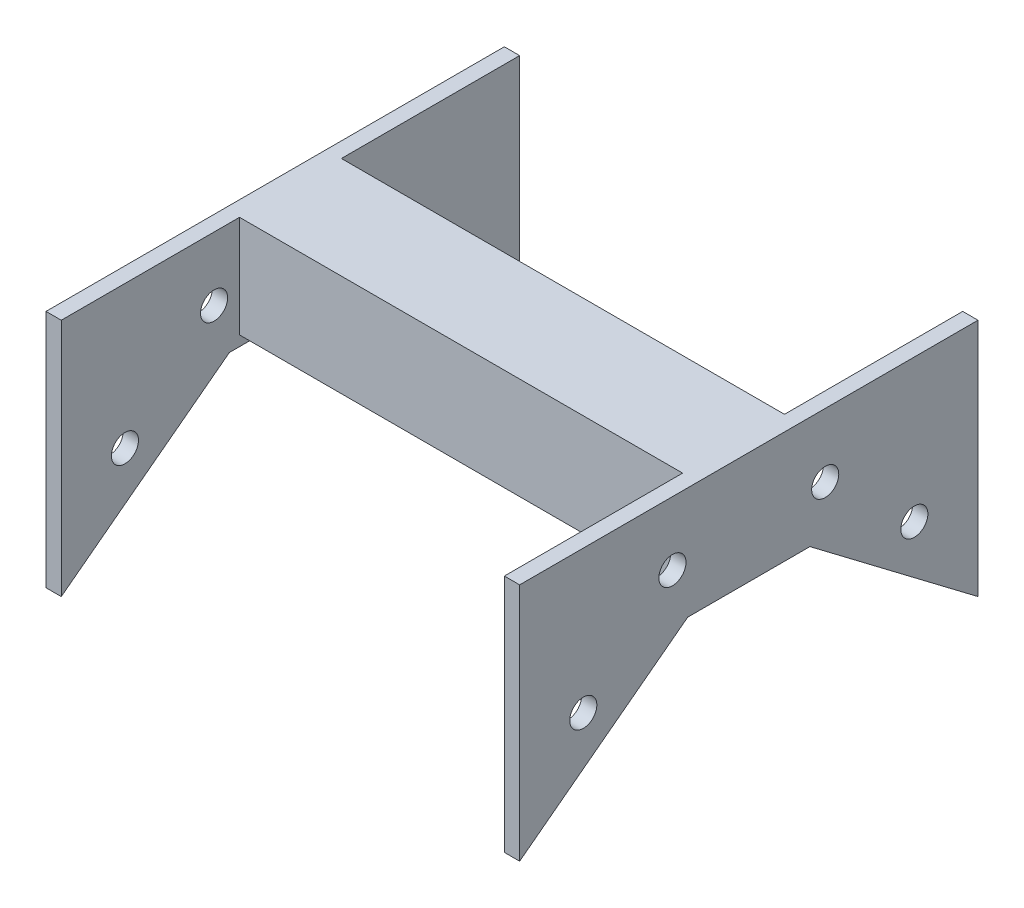
ISO-10303-21;
HEADER;
FILE_DESCRIPTION(('STEP AP214'),'2;1');
FILE_NAME('part.step','',(''),(''),'','','');
FILE_SCHEMA(('AUTOMOTIVE_DESIGN { 1 0 10303 214 1 1 1 1 }'));
ENDSEC;
DATA;
#1=APPLICATION_CONTEXT('core data for automotive mechanical design processes');
#2=APPLICATION_PROTOCOL_DEFINITION('international standard','automotive_design',2000,#1);
#3=PRODUCT_CONTEXT('',#1,'mechanical');
#4=PRODUCT('Part','Part','',(#3));
#5=PRODUCT_RELATED_PRODUCT_CATEGORY('part','',(#4));
#6=PRODUCT_DEFINITION_FORMATION('','',#4);
#7=PRODUCT_DEFINITION_CONTEXT('part definition',#1,'design');
#8=PRODUCT_DEFINITION('design','',#6,#7);
#9=PRODUCT_DEFINITION_SHAPE('','',#8);
#10=(LENGTH_UNIT() NAMED_UNIT(*) SI_UNIT(.MILLI.,.METRE.));
#11=(NAMED_UNIT(*) PLANE_ANGLE_UNIT() SI_UNIT($,.RADIAN.));
#12=(NAMED_UNIT(*) SI_UNIT($,.STERADIAN.) SOLID_ANGLE_UNIT());
#13=UNCERTAINTY_MEASURE_WITH_UNIT(LENGTH_MEASURE(1.E-05),#10,'distance_accuracy_value','');
#14=(GEOMETRIC_REPRESENTATION_CONTEXT(3) GLOBAL_UNCERTAINTY_ASSIGNED_CONTEXT((#13)) GLOBAL_UNIT_ASSIGNED_CONTEXT((#10,
#11,#12)) REPRESENTATION_CONTEXT('',''));
#15=CARTESIAN_POINT('',(0.,0.,0.));
#16=DIRECTION('',(0.,0.,1.));
#17=DIRECTION('',(1.,0.,0.));
#18=AXIS2_PLACEMENT_3D('',#15,#16,#17);
#19=CARTESIAN_POINT('',(2.7051,-32.6365797632206,58.293));
#20=DIRECTION('',(0.,0.79709214815401,0.603857687995462));
#21=DIRECTION('',(0.,-0.603857687995462,0.797092148154011));
#22=AXIS2_PLACEMENT_3D('',#19,#20,#21);
#23=PLANE('',#22);
#24=DIRECTION('',(0.,0.603857687995462,-0.79709214815401));
#25=VECTOR('',#24,1.);
#26=CARTESIAN_POINT('',(-1.1811,-32.6365797632206,58.293));
#27=LINE('',#26,#25);
#28=CARTESIAN_POINT('',(-1.1811,-32.6365797632206,58.293));
#29=VERTEX_POINT('',#28);
#30=CARTESIAN_POINT('',(-1.1811,-0.251579763220644,15.5448));
#31=VERTEX_POINT('',#30);
#32=EDGE_CURVE('E259',#29,#31,#27,.T.);
#33=ORIENTED_EDGE('',*,*,#32,.T.);
#34=DIRECTION('',(-1.,0.,0.));
#35=VECTOR('',#34,1.);
#36=CARTESIAN_POINT('',(2.7051,-0.251579763220644,15.5448));
#37=LINE('',#36,#35);
#38=CARTESIAN_POINT('',(2.7051,-0.251579763220644,15.5448));
#39=VERTEX_POINT('',#38);
#40=EDGE_CURVE('E11',#39,#31,#37,.T.);
#41=ORIENTED_EDGE('',*,*,#40,.F.);
#42=DIRECTION('',(0.,0.603857687995462,-0.79709214815401));
#43=VECTOR('',#42,1.);
#44=CARTESIAN_POINT('',(2.7051,-32.6365797632206,58.293));
#45=LINE('',#44,#43);
#46=CARTESIAN_POINT('',(2.7051,-32.6365797632206,58.293));
#47=VERTEX_POINT('',#46);
#48=EDGE_CURVE('E260',#47,#39,#45,.T.);
#49=ORIENTED_EDGE('',*,*,#48,.F.);
#50=DIRECTION('',(-1.,0.,0.));
#51=VECTOR('',#50,1.);
#52=CARTESIAN_POINT('',(2.7051,-32.6365797632206,58.293));
#53=LINE('',#52,#51);
#54=EDGE_CURVE('E275',#47,#29,#53,.T.);
#55=ORIENTED_EDGE('',*,*,#54,.T.);
#56=EDGE_LOOP('',(#33,#41,#49,#55));
#57=FACE_BOUND('',#56,.T.);
#58=ADVANCED_FACE('F35',(#57),#23,.F.);
#59=CARTESIAN_POINT('',(2.7051,-0.251579763220644,-15.5448));
#60=DIRECTION('',(0.,1.,0.));
#61=DIRECTION('',(0.,0.,1.));
#62=AXIS2_PLACEMENT_3D('',#59,#60,#61);
#63=PLANE('',#62);
#64=DIRECTION('',(0.,0.,-1.));
#65=VECTOR('',#64,1.);
#66=CARTESIAN_POINT('',(-1.1811,-0.251579763220644,-15.5448));
#67=LINE('',#66,#65);
#68=CARTESIAN_POINT('',(-1.1811,-0.251579763220644,-15.5448));
#69=VERTEX_POINT('',#68);
#70=EDGE_CURVE('E278',#31,#69,#67,.T.);
#71=ORIENTED_EDGE('',*,*,#70,.T.);
#72=DIRECTION('',(-1.,0.,0.));
#73=VECTOR('',#72,1.);
#74=CARTESIAN_POINT('',(2.7051,-0.251579763220644,-15.5448));
#75=LINE('',#74,#73);
#76=CARTESIAN_POINT('',(2.7051,-0.251579763220644,-15.5448));
#77=VERTEX_POINT('',#76);
#78=EDGE_CURVE('E42',#77,#69,#75,.T.);
#79=ORIENTED_EDGE('',*,*,#78,.F.);
#80=DIRECTION('',(0.,0.,-1.));
#81=VECTOR('',#80,1.);
#82=CARTESIAN_POINT('',(2.7051,-0.251579763220644,-15.5448));
#83=LINE('',#82,#81);
#84=EDGE_CURVE('E263',#39,#77,#83,.T.);
#85=ORIENTED_EDGE('',*,*,#84,.F.);
#86=ORIENTED_EDGE('',*,*,#40,.T.);
#87=EDGE_LOOP('',(#71,#79,#85,#86));
#88=FACE_BOUND('',#87,.T.);
#89=ADVANCED_FACE('F322',(#88),#63,.F.);
#90=CARTESIAN_POINT('',(2.7051,-32.6365797632206,-58.293));
#91=DIRECTION('',(0.,0.79709214815401,-0.603857687995462));
#92=DIRECTION('',(0.,0.603857687995462,0.797092148154011));
#93=AXIS2_PLACEMENT_3D('',#90,#91,#92);
#94=PLANE('',#93);
#95=DIRECTION('',(0.,-0.603857687995462,-0.79709214815401));
#96=VECTOR('',#95,1.);
#97=CARTESIAN_POINT('',(-1.1811,-32.6365797632206,-58.293));
#98=LINE('',#97,#96);
#99=CARTESIAN_POINT('',(-1.1811,-32.6365797632206,-58.293));
#100=VERTEX_POINT('',#99);
#101=EDGE_CURVE('E280',#69,#100,#98,.T.);
#102=ORIENTED_EDGE('',*,*,#101,.T.);
#103=DIRECTION('',(-1.,0.,0.));
#104=VECTOR('',#103,1.);
#105=CARTESIAN_POINT('',(2.7051,-32.6365797632206,-58.293));
#106=LINE('',#105,#104);
#107=CARTESIAN_POINT('',(2.7051,-32.6365797632206,-58.293));
#108=VERTEX_POINT('',#107);
#109=EDGE_CURVE('E295',#108,#100,#106,.T.);
#110=ORIENTED_EDGE('',*,*,#109,.F.);
#111=DIRECTION('',(0.,-0.603857687995462,-0.79709214815401));
#112=VECTOR('',#111,1.);
#113=CARTESIAN_POINT('',(2.7051,-32.6365797632206,-58.293));
#114=LINE('',#113,#112);
#115=EDGE_CURVE('E266',#77,#108,#114,.T.);
#116=ORIENTED_EDGE('',*,*,#115,.F.);
#117=ORIENTED_EDGE('',*,*,#78,.T.);
#118=EDGE_LOOP('',(#102,#110,#116,#117));
#119=FACE_BOUND('',#118,.T.);
#120=ADVANCED_FACE('F302',(#119),#94,.F.);
#121=CARTESIAN_POINT('',(2.7051,28.2472202367794,-58.293));
#122=DIRECTION('',(0.,0.,1.));
#123=DIRECTION('',(0.,-1.,0.));
#124=AXIS2_PLACEMENT_3D('',#121,#122,#123);
#125=PLANE('',#124);
#126=DIRECTION('',(0.,1.,0.));
#127=VECTOR('',#126,1.);
#128=CARTESIAN_POINT('',(-1.1811,28.2472202367794,-58.293));
#129=LINE('',#128,#127);
#130=CARTESIAN_POINT('',(-1.1811,28.2472202367794,-58.293));
#131=VERTEX_POINT('',#130);
#132=EDGE_CURVE('E282',#100,#131,#129,.T.);
#133=ORIENTED_EDGE('',*,*,#132,.T.);
#134=DIRECTION('',(-1.,0.,0.));
#135=VECTOR('',#134,1.);
#136=CARTESIAN_POINT('',(2.7051,28.2472202367794,-58.293));
#137=LINE('',#136,#135);
#138=CARTESIAN_POINT('',(2.7051,28.2472202367794,-58.293));
#139=VERTEX_POINT('',#138);
#140=EDGE_CURVE('E292',#139,#131,#137,.T.);
#141=ORIENTED_EDGE('',*,*,#140,.F.);
#142=DIRECTION('',(0.,1.,0.));
#143=VECTOR('',#142,1.);
#144=CARTESIAN_POINT('',(2.7051,28.2472202367794,-58.293));
#145=LINE('',#144,#143);
#146=EDGE_CURVE('E268',#108,#139,#145,.T.);
#147=ORIENTED_EDGE('',*,*,#146,.F.);
#148=ORIENTED_EDGE('',*,*,#109,.T.);
#149=EDGE_LOOP('',(#133,#141,#147,#148));
#150=FACE_BOUND('',#149,.T.);
#151=ADVANCED_FACE('F313',(#150),#125,.F.);
#152=CARTESIAN_POINT('',(2.7051,28.2472202367794,-58.293));
#153=DIRECTION('',(0.,-1.,0.));
#154=DIRECTION('',(0.,0.,-1.));
#155=AXIS2_PLACEMENT_3D('',#152,#153,#154);
#156=PLANE('',#155);
#157=DIRECTION('',(0.,0.,1.));
#158=VECTOR('',#157,1.);
#159=CARTESIAN_POINT('',(-1.1811,28.2472202367794,-58.293));
#160=LINE('',#159,#158);
#161=CARTESIAN_POINT('',(-1.1811,28.2472202367794,58.293));
#162=VERTEX_POINT('',#161);
#163=EDGE_CURVE('E284',#131,#162,#160,.T.);
#164=ORIENTED_EDGE('',*,*,#163,.T.);
#165=DIRECTION('',(-1.,0.,0.));
#166=VECTOR('',#165,1.);
#167=CARTESIAN_POINT('',(2.7051,28.2472202367794,58.293));
#168=LINE('',#167,#166);
#169=CARTESIAN_POINT('',(2.7051,28.2472202367794,58.293));
#170=VERTEX_POINT('',#169);
#171=EDGE_CURVE('E289',#170,#162,#168,.T.);
#172=ORIENTED_EDGE('',*,*,#171,.F.);
#173=DIRECTION('',(0.,0.,1.));
#174=VECTOR('',#173,1.);
#175=CARTESIAN_POINT('',(2.7051,28.2472202367794,-58.293));
#176=LINE('',#175,#174);
#177=CARTESIAN_POINT('',(2.7051,28.2472202367794,12.954));
#178=VERTEX_POINT('',#177);
#179=EDGE_CURVE('E270',#178,#170,#176,.T.);
#180=ORIENTED_EDGE('',*,*,#179,.F.);
#181=DIRECTION('',(-1.,0.,0.));
#182=VECTOR('',#181,1.);
#183=CARTESIAN_POINT('',(59.055,28.2472202367794,12.954));
#184=LINE('',#183,#182);
#185=CARTESIAN_POINT('',(115.4049,28.2472202367794,12.954));
#186=VERTEX_POINT('',#185);
#187=EDGE_CURVE('E154',#186,#178,#184,.T.);
#188=ORIENTED_EDGE('',*,*,#187,.F.);
#189=DIRECTION('',(0.,0.,1.));
#190=VECTOR('',#189,1.);
#191=CARTESIAN_POINT('',(115.4049,28.2472202367794,-58.293));
#192=LINE('',#191,#190);
#193=CARTESIAN_POINT('',(115.4049,28.2472202367794,58.293));
#194=VERTEX_POINT('',#193);
#195=EDGE_CURVE('E168',#186,#194,#192,.T.);
#196=ORIENTED_EDGE('',*,*,#195,.T.);
#197=DIRECTION('',(1.,0.,0.));
#198=VECTOR('',#197,1.);
#199=CARTESIAN_POINT('',(115.4049,28.2472202367794,58.293));
#200=LINE('',#199,#198);
#201=CARTESIAN_POINT('',(119.2911,28.2472202367794,58.293));
#202=VERTEX_POINT('',#201);
#203=EDGE_CURVE('E211',#194,#202,#200,.T.);
#204=ORIENTED_EDGE('',*,*,#203,.T.);
#205=DIRECTION('',(0.,0.,1.));
#206=VECTOR('',#205,1.);
#207=CARTESIAN_POINT('',(119.2911,28.2472202367794,-58.293));
#208=LINE('',#207,#206);
#209=CARTESIAN_POINT('',(119.2911,28.2472202367794,-58.293));
#210=VERTEX_POINT('',#209);
#211=EDGE_CURVE('E205',#210,#202,#208,.T.);
#212=ORIENTED_EDGE('',*,*,#211,.F.);
#213=DIRECTION('',(1.,0.,0.));
#214=VECTOR('',#213,1.);
#215=CARTESIAN_POINT('',(115.4049,28.2472202367794,-58.293));
#216=LINE('',#215,#214);
#217=CARTESIAN_POINT('',(115.4049,28.2472202367794,-58.293));
#218=VERTEX_POINT('',#217);
#219=EDGE_CURVE('E214',#218,#210,#216,.T.);
#220=ORIENTED_EDGE('',*,*,#219,.F.);
#221=CARTESIAN_POINT('',(115.4049,28.2472202367794,-12.954));
#222=VERTEX_POINT('',#221);
#223=EDGE_CURVE('E188',#218,#222,#192,.T.);
#224=ORIENTED_EDGE('',*,*,#223,.T.);
#225=DIRECTION('',(-1.,0.,0.));
#226=VECTOR('',#225,1.);
#227=CARTESIAN_POINT('',(59.055,28.2472202367794,-12.954));
#228=LINE('',#227,#226);
#229=CARTESIAN_POINT('',(2.7051,28.2472202367794,-12.954));
#230=VERTEX_POINT('',#229);
#231=EDGE_CURVE('E256',#222,#230,#228,.T.);
#232=ORIENTED_EDGE('',*,*,#231,.T.);
#233=EDGE_CURVE('E271',#139,#230,#176,.T.);
#234=ORIENTED_EDGE('',*,*,#233,.F.);
#235=ORIENTED_EDGE('',*,*,#140,.T.);
#236=EDGE_LOOP('',(#164,#172,#180,#188,#196,#204,#212,#220,#224,#232,#234,#235));
#237=FACE_BOUND('',#236,.T.);
#238=ADVANCED_FACE('F317',(#237),#156,.F.);
#239=CARTESIAN_POINT('',(2.7051,28.2472202367794,58.293));
#240=DIRECTION('',(0.,0.,-1.));
#241=DIRECTION('',(0.,1.,0.));
#242=AXIS2_PLACEMENT_3D('',#239,#240,#241);
#243=PLANE('',#242);
#244=DIRECTION('',(0.,-1.,0.));
#245=VECTOR('',#244,1.);
#246=CARTESIAN_POINT('',(-1.1811,28.2472202367794,58.293));
#247=LINE('',#246,#245);
#248=EDGE_CURVE('E264',#162,#29,#247,.T.);
#249=ORIENTED_EDGE('',*,*,#248,.T.);
#250=ORIENTED_EDGE('',*,*,#54,.F.);
#251=DIRECTION('',(0.,-1.,0.));
#252=VECTOR('',#251,1.);
#253=CARTESIAN_POINT('',(2.7051,28.2472202367794,58.293));
#254=LINE('',#253,#252);
#255=EDGE_CURVE('E273',#170,#47,#254,.T.);
#256=ORIENTED_EDGE('',*,*,#255,.F.);
#257=ORIENTED_EDGE('',*,*,#171,.T.);
#258=EDGE_LOOP('',(#249,#250,#256,#257));
#259=FACE_BOUND('',#258,.T.);
#260=ADVANCED_FACE('F326',(#259),#243,.F.);
#261=CARTESIAN_POINT('',(2.7051,-0.251579763220642,0.));
#262=DIRECTION('',(1.,0.,0.));
#263=DIRECTION('',(0.,0.,-1.));
#264=AXIS2_PLACEMENT_3D('',#261,#262,#263);
#265=PLANE('',#264);
#266=CARTESIAN_POINT('',(2.7051,12.0547202367794,-19.431));
#267=DIRECTION('',(1.,0.,0.));
#268=DIRECTION('',(0.,0.,-1.));
#269=AXIS2_PLACEMENT_3D('',#266,#267,#268);
#270=CIRCLE('',#269,3.445764);
#271=CARTESIAN_POINT('',(2.7051,12.0547202367794,-22.876764));
#272=VERTEX_POINT('',#271);
#273=EDGE_CURVE('E247',#272,#272,#270,.T.);
#274=ORIENTED_EDGE('',*,*,#273,.F.);
#275=EDGE_LOOP('',(#274));
#276=FACE_BOUND('',#275,.T.);
#277=CARTESIAN_POINT('',(2.7051,-8.02397976322064,-42.1005));
#278=DIRECTION('',(1.,0.,0.));
#279=DIRECTION('',(0.,0.,-1.));
#280=AXIS2_PLACEMENT_3D('',#277,#278,#279);
#281=CIRCLE('',#280,3.445764);
#282=CARTESIAN_POINT('',(2.7051,-8.02397976322064,-45.546264));
#283=VERTEX_POINT('',#282);
#284=EDGE_CURVE('E244',#283,#283,#281,.T.);
#285=ORIENTED_EDGE('',*,*,#284,.F.);
#286=EDGE_LOOP('',(#285));
#287=FACE_BOUND('',#286,.T.);
#288=CARTESIAN_POINT('',(2.7051,-8.02397976322064,42.1005));
#289=DIRECTION('',(1.,0.,0.));
#290=DIRECTION('',(0.,0.,-1.));
#291=AXIS2_PLACEMENT_3D('',#288,#289,#290);
#292=CIRCLE('',#291,3.445764);
#293=CARTESIAN_POINT('',(2.7051,-8.02397976322064,38.654736));
#294=VERTEX_POINT('',#293);
#295=EDGE_CURVE('E241',#294,#294,#292,.T.);
#296=ORIENTED_EDGE('',*,*,#295,.F.);
#297=EDGE_LOOP('',(#296));
#298=FACE_BOUND('',#297,.T.);
#299=CARTESIAN_POINT('',(2.7051,12.0547202367794,19.431));
#300=DIRECTION('',(1.,0.,0.));
#301=DIRECTION('',(0.,0.,-1.));
#302=AXIS2_PLACEMENT_3D('',#299,#300,#301);
#303=CIRCLE('',#302,3.445764);
#304=CARTESIAN_POINT('',(2.7051,12.0547202367794,15.985236));
#305=VERTEX_POINT('',#304);
#306=EDGE_CURVE('E238',#305,#305,#303,.T.);
#307=ORIENTED_EDGE('',*,*,#306,.F.);
#308=EDGE_LOOP('',(#307));
#309=FACE_BOUND('',#308,.T.);
#310=DIRECTION('',(0.,1.,0.));
#311=VECTOR('',#310,1.);
#312=CARTESIAN_POINT('',(2.7051,28.2472202367794,-12.954));
#313=LINE('',#312,#311);
#314=CARTESIAN_POINT('',(2.7051,2.33922023677936,-12.954));
#315=VERTEX_POINT('',#314);
#316=EDGE_CURVE('E49',#315,#230,#313,.T.);
#317=ORIENTED_EDGE('',*,*,#316,.F.);
#318=DIRECTION('',(0.,0.,-1.));
#319=VECTOR('',#318,1.);
#320=CARTESIAN_POINT('',(2.7051,2.33922023677937,12.954));
#321=LINE('',#320,#319);
#322=CARTESIAN_POINT('',(2.7051,2.33922023677937,12.954));
#323=VERTEX_POINT('',#322);
#324=EDGE_CURVE('E252',#323,#315,#321,.T.);
#325=ORIENTED_EDGE('',*,*,#324,.F.);
#326=DIRECTION('',(0.,-1.,0.));
#327=VECTOR('',#326,1.);
#328=CARTESIAN_POINT('',(2.7051,28.2472202367794,12.954));
#329=LINE('',#328,#327);
#330=EDGE_CURVE('E55',#178,#323,#329,.T.);
#331=ORIENTED_EDGE('',*,*,#330,.F.);
#332=ORIENTED_EDGE('',*,*,#179,.T.);
#333=ORIENTED_EDGE('',*,*,#255,.T.);
#334=ORIENTED_EDGE('',*,*,#48,.T.);
#335=ORIENTED_EDGE('',*,*,#84,.T.);
#336=ORIENTED_EDGE('',*,*,#115,.T.);
#337=ORIENTED_EDGE('',*,*,#146,.T.);
#338=ORIENTED_EDGE('',*,*,#233,.T.);
#339=EDGE_LOOP('',(#317,#325,#331,#332,#333,#334,#335,#336,#337,#338));
#340=FACE_BOUND('',#339,.T.);
#341=ADVANCED_FACE('F319',(#276,#287,#298,#309,#340),#265,.T.);
#342=CARTESIAN_POINT('',(-1.1811,-0.251579763220642,0.));
#343=DIRECTION('',(1.,0.,0.));
#344=DIRECTION('',(0.,0.,-1.));
#345=AXIS2_PLACEMENT_3D('',#342,#343,#344);
#346=PLANE('',#345);
#347=CARTESIAN_POINT('',(-1.1811,12.0547202367794,-19.431));
#348=DIRECTION('',(-1.,0.,0.));
#349=DIRECTION('',(0.,0.,-1.));
#350=AXIS2_PLACEMENT_3D('',#347,#348,#349);
#351=CIRCLE('',#350,3.445764);
#352=CARTESIAN_POINT('',(-1.1811,12.0547202367794,-22.876764));
#353=VERTEX_POINT('',#352);
#354=EDGE_CURVE('E226',#353,#353,#351,.T.);
#355=ORIENTED_EDGE('',*,*,#354,.F.);
#356=EDGE_LOOP('',(#355));
#357=FACE_BOUND('',#356,.T.);
#358=CARTESIAN_POINT('',(-1.1811,-8.02397976322064,-42.1005));
#359=DIRECTION('',(-1.,0.,0.));
#360=DIRECTION('',(0.,0.,-1.));
#361=AXIS2_PLACEMENT_3D('',#358,#359,#360);
#362=CIRCLE('',#361,3.445764);
#363=CARTESIAN_POINT('',(-1.1811,-8.02397976322064,-45.546264));
#364=VERTEX_POINT('',#363);
#365=EDGE_CURVE('E231',#364,#364,#362,.T.);
#366=ORIENTED_EDGE('',*,*,#365,.F.);
#367=EDGE_LOOP('',(#366));
#368=FACE_BOUND('',#367,.T.);
#369=CARTESIAN_POINT('',(-1.1811,-8.02397976322064,42.1005));
#370=DIRECTION('',(-1.,0.,0.));
#371=DIRECTION('',(0.,0.,1.));
#372=AXIS2_PLACEMENT_3D('',#369,#370,#371);
#373=CIRCLE('',#372,3.445764);
#374=CARTESIAN_POINT('',(-1.1811,-8.02397976322064,45.546264));
#375=VERTEX_POINT('',#374);
#376=EDGE_CURVE('E227',#375,#375,#373,.T.);
#377=ORIENTED_EDGE('',*,*,#376,.F.);
#378=EDGE_LOOP('',(#377));
#379=FACE_BOUND('',#378,.T.);
#380=CARTESIAN_POINT('',(-1.1811,12.0547202367794,19.431));
#381=DIRECTION('',(-1.,0.,0.));
#382=DIRECTION('',(0.,0.,1.));
#383=AXIS2_PLACEMENT_3D('',#380,#381,#382);
#384=CIRCLE('',#383,3.445764);
#385=CARTESIAN_POINT('',(-1.1811,12.0547202367794,22.876764));
#386=VERTEX_POINT('',#385);
#387=EDGE_CURVE('E230',#386,#386,#384,.T.);
#388=ORIENTED_EDGE('',*,*,#387,.F.);
#389=EDGE_LOOP('',(#388));
#390=FACE_BOUND('',#389,.T.);
#391=ORIENTED_EDGE('',*,*,#32,.F.);
#392=ORIENTED_EDGE('',*,*,#248,.F.);
#393=ORIENTED_EDGE('',*,*,#163,.F.);
#394=ORIENTED_EDGE('',*,*,#132,.F.);
#395=ORIENTED_EDGE('',*,*,#101,.F.);
#396=ORIENTED_EDGE('',*,*,#70,.F.);
#397=EDGE_LOOP('',(#391,#392,#393,#394,#395,#396));
#398=FACE_BOUND('',#397,.T.);
#399=ADVANCED_FACE('F308',(#357,#368,#379,#390,#398),#346,.F.);
#400=CARTESIAN_POINT('',(59.055,28.2472202367794,-12.954));
#401=DIRECTION('',(0.,0.,1.));
#402=DIRECTION('',(0.,-1.,0.));
#403=AXIS2_PLACEMENT_3D('',#400,#401,#402);
#404=PLANE('',#403);
#405=ORIENTED_EDGE('',*,*,#316,.T.);
#406=ORIENTED_EDGE('',*,*,#231,.F.);
#407=DIRECTION('',(0.,1.,0.));
#408=VECTOR('',#407,1.);
#409=CARTESIAN_POINT('',(115.4049,28.2472202367794,-12.954));
#410=LINE('',#409,#408);
#411=CARTESIAN_POINT('',(115.4049,2.33922023677936,-12.954));
#412=VERTEX_POINT('',#411);
#413=EDGE_CURVE('E169',#412,#222,#410,.T.);
#414=ORIENTED_EDGE('',*,*,#413,.F.);
#415=DIRECTION('',(-1.,0.,0.));
#416=VECTOR('',#415,1.);
#417=CARTESIAN_POINT('',(59.055,2.33922023677936,-12.954));
#418=LINE('',#417,#416);
#419=EDGE_CURVE('E155',#412,#315,#418,.T.);
#420=ORIENTED_EDGE('',*,*,#419,.T.);
#421=EDGE_LOOP('',(#405,#406,#414,#420));
#422=FACE_BOUND('',#421,.T.);
#423=ADVANCED_FACE('F342',(#422),#404,.F.);
#424=CARTESIAN_POINT('',(59.055,28.2472202367794,12.954));
#425=DIRECTION('',(0.,0.,-1.));
#426=DIRECTION('',(0.,1.,0.));
#427=AXIS2_PLACEMENT_3D('',#424,#425,#426);
#428=PLANE('',#427);
#429=ORIENTED_EDGE('',*,*,#330,.T.);
#430=DIRECTION('',(-1.,0.,0.));
#431=VECTOR('',#430,1.);
#432=CARTESIAN_POINT('',(59.055,2.33922023677937,12.954));
#433=LINE('',#432,#431);
#434=CARTESIAN_POINT('',(115.4049,2.33922023677937,12.954));
#435=VERTEX_POINT('',#434);
#436=EDGE_CURVE('E146',#435,#323,#433,.T.);
#437=ORIENTED_EDGE('',*,*,#436,.F.);
#438=DIRECTION('',(0.,-1.,0.));
#439=VECTOR('',#438,1.);
#440=CARTESIAN_POINT('',(115.4049,28.2472202367794,12.954));
#441=LINE('',#440,#439);
#442=EDGE_CURVE('E151',#186,#435,#441,.T.);
#443=ORIENTED_EDGE('',*,*,#442,.F.);
#444=ORIENTED_EDGE('',*,*,#187,.T.);
#445=EDGE_LOOP('',(#429,#437,#443,#444));
#446=FACE_BOUND('',#445,.T.);
#447=ADVANCED_FACE('F148',(#446),#428,.F.);
#448=CARTESIAN_POINT('',(59.055,2.33922023677937,12.954));
#449=DIRECTION('',(0.,1.,0.));
#450=DIRECTION('',(0.,0.,1.));
#451=AXIS2_PLACEMENT_3D('',#448,#449,#450);
#452=PLANE('',#451);
#453=ORIENTED_EDGE('',*,*,#324,.T.);
#454=ORIENTED_EDGE('',*,*,#419,.F.);
#455=DIRECTION('',(0.,0.,-1.));
#456=VECTOR('',#455,1.);
#457=CARTESIAN_POINT('',(115.4049,2.33922023677937,12.954));
#458=LINE('',#457,#456);
#459=EDGE_CURVE('E158',#435,#412,#458,.T.);
#460=ORIENTED_EDGE('',*,*,#459,.F.);
#461=ORIENTED_EDGE('',*,*,#436,.T.);
#462=EDGE_LOOP('',(#453,#454,#460,#461));
#463=FACE_BOUND('',#462,.T.);
#464=ADVANCED_FACE('F159',(#463),#452,.F.);
#465=CARTESIAN_POINT('',(55.1688,12.0547202367794,19.431));
#466=DIRECTION('',(-1.,0.,0.));
#467=DIRECTION('',(0.,0.,1.));
#468=AXIS2_PLACEMENT_3D('',#465,#466,#467);
#469=CYLINDRICAL_SURFACE('',#468,3.445764);
#470=ORIENTED_EDGE('',*,*,#306,.T.);
#471=EDGE_LOOP('',(#470));
#472=FACE_BOUND('',#471,.T.);
#473=ORIENTED_EDGE('',*,*,#387,.T.);
#474=EDGE_LOOP('',(#473));
#475=FACE_BOUND('',#474,.T.);
#476=ADVANCED_FACE('F379',(#472,#475),#469,.F.);
#477=CARTESIAN_POINT('',(55.1688,-8.02397976322064,42.1005));
#478=DIRECTION('',(-1.,0.,0.));
#479=DIRECTION('',(0.,0.,1.));
#480=AXIS2_PLACEMENT_3D('',#477,#478,#479);
#481=CYLINDRICAL_SURFACE('',#480,3.445764);
#482=ORIENTED_EDGE('',*,*,#295,.T.);
#483=EDGE_LOOP('',(#482));
#484=FACE_BOUND('',#483,.T.);
#485=ORIENTED_EDGE('',*,*,#376,.T.);
#486=EDGE_LOOP('',(#485));
#487=FACE_BOUND('',#486,.T.);
#488=ADVANCED_FACE('F382',(#484,#487),#481,.F.);
#489=CARTESIAN_POINT('',(55.1688,-8.02397976322064,-42.1005));
#490=DIRECTION('',(-1.,0.,0.));
#491=DIRECTION('',(0.,0.,1.));
#492=AXIS2_PLACEMENT_3D('',#489,#490,#491);
#493=CYLINDRICAL_SURFACE('',#492,3.445764);
#494=ORIENTED_EDGE('',*,*,#284,.T.);
#495=EDGE_LOOP('',(#494));
#496=FACE_BOUND('',#495,.T.);
#497=ORIENTED_EDGE('',*,*,#365,.T.);
#498=EDGE_LOOP('',(#497));
#499=FACE_BOUND('',#498,.T.);
#500=ADVANCED_FACE('F390',(#496,#499),#493,.F.);
#501=CARTESIAN_POINT('',(55.1688,12.0547202367794,-19.431));
#502=DIRECTION('',(-1.,0.,0.));
#503=DIRECTION('',(0.,0.,1.));
#504=AXIS2_PLACEMENT_3D('',#501,#502,#503);
#505=CYLINDRICAL_SURFACE('',#504,3.445764);
#506=ORIENTED_EDGE('',*,*,#273,.T.);
#507=EDGE_LOOP('',(#506));
#508=FACE_BOUND('',#507,.T.);
#509=ORIENTED_EDGE('',*,*,#354,.T.);
#510=EDGE_LOOP('',(#509));
#511=FACE_BOUND('',#510,.T.);
#512=ADVANCED_FACE('F395',(#508,#511),#505,.F.);
#513=CARTESIAN_POINT('',(115.4049,-32.6365797632206,58.293));
#514=DIRECTION('',(0.,0.79709214815401,0.603857687995462));
#515=DIRECTION('',(0.,-0.603857687995462,0.797092148154011));
#516=AXIS2_PLACEMENT_3D('',#513,#514,#515);
#517=PLANE('',#516);
#518=DIRECTION('',(0.,0.603857687995462,-0.79709214815401));
#519=VECTOR('',#518,1.);
#520=CARTESIAN_POINT('',(119.2911,-32.6365797632206,58.293));
#521=LINE('',#520,#519);
#522=CARTESIAN_POINT('',(119.2911,-32.6365797632206,58.293));
#523=VERTEX_POINT('',#522);
#524=CARTESIAN_POINT('',(119.2911,-0.251579763220644,15.5448));
#525=VERTEX_POINT('',#524);
#526=EDGE_CURVE('E164',#523,#525,#521,.T.);
#527=ORIENTED_EDGE('',*,*,#526,.F.);
#528=DIRECTION('',(1.,0.,0.));
#529=VECTOR('',#528,1.);
#530=CARTESIAN_POINT('',(115.4049,-32.6365797632206,58.293));
#531=LINE('',#530,#529);
#532=CARTESIAN_POINT('',(115.4049,-32.6365797632206,58.293));
#533=VERTEX_POINT('',#532);
#534=EDGE_CURVE('E193',#533,#523,#531,.T.);
#535=ORIENTED_EDGE('',*,*,#534,.F.);
#536=DIRECTION('',(0.,0.603857687995462,-0.79709214815401));
#537=VECTOR('',#536,1.);
#538=CARTESIAN_POINT('',(115.4049,-32.6365797632206,58.293));
#539=LINE('',#538,#537);
#540=CARTESIAN_POINT('',(115.4049,-0.251579763220644,15.5448));
#541=VERTEX_POINT('',#540);
#542=EDGE_CURVE('E175',#533,#541,#539,.T.);
#543=ORIENTED_EDGE('',*,*,#542,.T.);
#544=DIRECTION('',(1.,0.,0.));
#545=VECTOR('',#544,1.);
#546=CARTESIAN_POINT('',(115.4049,-0.251579763220644,15.5448));
#547=LINE('',#546,#545);
#548=EDGE_CURVE('E223',#541,#525,#547,.T.);
#549=ORIENTED_EDGE('',*,*,#548,.T.);
#550=EDGE_LOOP('',(#527,#535,#543,#549));
#551=FACE_BOUND('',#550,.T.);
#552=ADVANCED_FACE('F398',(#551),#517,.F.);
#553=CARTESIAN_POINT('',(115.4049,-0.251579763220644,-15.5448));
#554=DIRECTION('',(0.,1.,0.));
#555=DIRECTION('',(0.,0.,1.));
#556=AXIS2_PLACEMENT_3D('',#553,#554,#555);
#557=PLANE('',#556);
#558=DIRECTION('',(0.,0.,-1.));
#559=VECTOR('',#558,1.);
#560=CARTESIAN_POINT('',(119.2911,-0.251579763220644,-15.5448));
#561=LINE('',#560,#559);
#562=CARTESIAN_POINT('',(119.2911,-0.251579763220644,-15.5448));
#563=VERTEX_POINT('',#562);
#564=EDGE_CURVE('E196',#525,#563,#561,.T.);
#565=ORIENTED_EDGE('',*,*,#564,.F.);
#566=ORIENTED_EDGE('',*,*,#548,.F.);
#567=DIRECTION('',(0.,0.,-1.));
#568=VECTOR('',#567,1.);
#569=CARTESIAN_POINT('',(115.4049,-0.251579763220644,-15.5448));
#570=LINE('',#569,#568);
#571=CARTESIAN_POINT('',(115.4049,-0.251579763220644,-15.5448));
#572=VERTEX_POINT('',#571);
#573=EDGE_CURVE('E178',#541,#572,#570,.T.);
#574=ORIENTED_EDGE('',*,*,#573,.T.);
#575=DIRECTION('',(1.,0.,0.));
#576=VECTOR('',#575,1.);
#577=CARTESIAN_POINT('',(115.4049,-0.251579763220644,-15.5448));
#578=LINE('',#577,#576);
#579=EDGE_CURVE('E220',#572,#563,#578,.T.);
#580=ORIENTED_EDGE('',*,*,#579,.T.);
#581=EDGE_LOOP('',(#565,#566,#574,#580));
#582=FACE_BOUND('',#581,.T.);
#583=ADVANCED_FACE('F405',(#582),#557,.F.);
#584=CARTESIAN_POINT('',(115.4049,-32.6365797632206,-58.293));
#585=DIRECTION('',(0.,0.79709214815401,-0.603857687995462));
#586=DIRECTION('',(0.,0.603857687995462,0.797092148154011));
#587=AXIS2_PLACEMENT_3D('',#584,#585,#586);
#588=PLANE('',#587);
#589=DIRECTION('',(0.,-0.603857687995462,-0.79709214815401));
#590=VECTOR('',#589,1.);
#591=CARTESIAN_POINT('',(119.2911,-32.6365797632206,-58.293));
#592=LINE('',#591,#590);
#593=CARTESIAN_POINT('',(119.2911,-32.6365797632206,-58.293));
#594=VERTEX_POINT('',#593);
#595=EDGE_CURVE('E199',#563,#594,#592,.T.);
#596=ORIENTED_EDGE('',*,*,#595,.F.);
#597=ORIENTED_EDGE('',*,*,#579,.F.);
#598=DIRECTION('',(0.,-0.603857687995462,-0.79709214815401));
#599=VECTOR('',#598,1.);
#600=CARTESIAN_POINT('',(115.4049,-32.6365797632206,-58.293));
#601=LINE('',#600,#599);
#602=CARTESIAN_POINT('',(115.4049,-32.6365797632206,-58.293));
#603=VERTEX_POINT('',#602);
#604=EDGE_CURVE('E182',#572,#603,#601,.T.);
#605=ORIENTED_EDGE('',*,*,#604,.T.);
#606=DIRECTION('',(1.,0.,0.));
#607=VECTOR('',#606,1.);
#608=CARTESIAN_POINT('',(115.4049,-32.6365797632206,-58.293));
#609=LINE('',#608,#607);
#610=EDGE_CURVE('E217',#603,#594,#609,.T.);
#611=ORIENTED_EDGE('',*,*,#610,.T.);
#612=EDGE_LOOP('',(#596,#597,#605,#611));
#613=FACE_BOUND('',#612,.T.);
#614=ADVANCED_FACE('F337',(#613),#588,.F.);
#615=CARTESIAN_POINT('',(115.4049,28.2472202367794,-58.293));
#616=DIRECTION('',(0.,0.,1.));
#617=DIRECTION('',(0.,-1.,0.));
#618=AXIS2_PLACEMENT_3D('',#615,#616,#617);
#619=PLANE('',#618);
#620=DIRECTION('',(0.,1.,0.));
#621=VECTOR('',#620,1.);
#622=CARTESIAN_POINT('',(119.2911,28.2472202367794,-58.293));
#623=LINE('',#622,#621);
#624=EDGE_CURVE('E202',#594,#210,#623,.T.);
#625=ORIENTED_EDGE('',*,*,#624,.F.);
#626=ORIENTED_EDGE('',*,*,#610,.F.);
#627=DIRECTION('',(0.,1.,0.));
#628=VECTOR('',#627,1.);
#629=CARTESIAN_POINT('',(115.4049,28.2472202367794,-58.293));
#630=LINE('',#629,#628);
#631=EDGE_CURVE('E185',#603,#218,#630,.T.);
#632=ORIENTED_EDGE('',*,*,#631,.T.);
#633=ORIENTED_EDGE('',*,*,#219,.T.);
#634=EDGE_LOOP('',(#625,#626,#632,#633));
#635=FACE_BOUND('',#634,.T.);
#636=ADVANCED_FACE('F335',(#635),#619,.F.);
#637=CARTESIAN_POINT('',(115.4049,28.2472202367794,58.293));
#638=DIRECTION('',(0.,0.,-1.));
#639=DIRECTION('',(0.,1.,0.));
#640=AXIS2_PLACEMENT_3D('',#637,#638,#639);
#641=PLANE('',#640);
#642=DIRECTION('',(0.,-1.,0.));
#643=VECTOR('',#642,1.);
#644=CARTESIAN_POINT('',(119.2911,28.2472202367794,58.293));
#645=LINE('',#644,#643);
#646=EDGE_CURVE('E179',#202,#523,#645,.T.);
#647=ORIENTED_EDGE('',*,*,#646,.F.);
#648=ORIENTED_EDGE('',*,*,#203,.F.);
#649=DIRECTION('',(0.,-1.,0.));
#650=VECTOR('',#649,1.);
#651=CARTESIAN_POINT('',(115.4049,28.2472202367794,58.293));
#652=LINE('',#651,#650);
#653=EDGE_CURVE('E191',#194,#533,#652,.T.);
#654=ORIENTED_EDGE('',*,*,#653,.T.);
#655=ORIENTED_EDGE('',*,*,#534,.T.);
#656=EDGE_LOOP('',(#647,#648,#654,#655));
#657=FACE_BOUND('',#656,.T.);
#658=ADVANCED_FACE('F414',(#657),#641,.F.);
#659=CARTESIAN_POINT('',(115.4049,-0.251579763220642,0.));
#660=DIRECTION('',(-1.,0.,0.));
#661=DIRECTION('',(0.,0.,-1.));
#662=AXIS2_PLACEMENT_3D('',#659,#660,#661);
#663=PLANE('',#662);
#664=CARTESIAN_POINT('',(115.4049,12.0547202367794,-19.431));
#665=DIRECTION('',(1.,0.,0.));
#666=DIRECTION('',(0.,0.,-1.));
#667=AXIS2_PLACEMENT_3D('',#664,#665,#666);
#668=CIRCLE('',#667,3.445764);
#669=CARTESIAN_POINT('',(115.4049,12.0547202367794,-22.876764));
#670=VERTEX_POINT('',#669);
#671=EDGE_CURVE('E171',#670,#670,#668,.T.);
#672=ORIENTED_EDGE('',*,*,#671,.T.);
#673=EDGE_LOOP('',(#672));
#674=FACE_BOUND('',#673,.T.);
#675=CARTESIAN_POINT('',(115.4049,-8.02397976322064,-42.1005));
#676=DIRECTION('',(1.,0.,0.));
#677=DIRECTION('',(0.,0.,-1.));
#678=AXIS2_PLACEMENT_3D('',#675,#676,#677);
#679=CIRCLE('',#678,3.445764);
#680=CARTESIAN_POINT('',(115.4049,-8.02397976322064,-45.546264));
#681=VERTEX_POINT('',#680);
#682=EDGE_CURVE('E463',#681,#681,#679,.T.);
#683=ORIENTED_EDGE('',*,*,#682,.T.);
#684=EDGE_LOOP('',(#683));
#685=FACE_BOUND('',#684,.T.);
#686=CARTESIAN_POINT('',(115.4049,-8.02397976322064,42.1005));
#687=DIRECTION('',(1.,0.,0.));
#688=DIRECTION('',(0.,0.,-1.));
#689=AXIS2_PLACEMENT_3D('',#686,#687,#688);
#690=CIRCLE('',#689,3.445764);
#691=CARTESIAN_POINT('',(115.4049,-8.02397976322064,38.654736));
#692=VERTEX_POINT('',#691);
#693=EDGE_CURVE('E443',#692,#692,#690,.T.);
#694=ORIENTED_EDGE('',*,*,#693,.T.);
#695=EDGE_LOOP('',(#694));
#696=FACE_BOUND('',#695,.T.);
#697=CARTESIAN_POINT('',(115.4049,12.0547202367794,19.431));
#698=DIRECTION('',(1.,0.,0.));
#699=DIRECTION('',(0.,0.,-1.));
#700=AXIS2_PLACEMENT_3D('',#697,#698,#699);
#701=CIRCLE('',#700,3.445764);
#702=CARTESIAN_POINT('',(115.4049,12.0547202367794,15.985236));
#703=VERTEX_POINT('',#702);
#704=EDGE_CURVE('E452',#703,#703,#701,.T.);
#705=ORIENTED_EDGE('',*,*,#704,.T.);
#706=EDGE_LOOP('',(#705));
#707=FACE_BOUND('',#706,.T.);
#708=ORIENTED_EDGE('',*,*,#413,.T.);
#709=ORIENTED_EDGE('',*,*,#223,.F.);
#710=ORIENTED_EDGE('',*,*,#631,.F.);
#711=ORIENTED_EDGE('',*,*,#604,.F.);
#712=ORIENTED_EDGE('',*,*,#573,.F.);
#713=ORIENTED_EDGE('',*,*,#542,.F.);
#714=ORIENTED_EDGE('',*,*,#653,.F.);
#715=ORIENTED_EDGE('',*,*,#195,.F.);
#716=ORIENTED_EDGE('',*,*,#442,.T.);
#717=ORIENTED_EDGE('',*,*,#459,.T.);
#718=EDGE_LOOP('',(#708,#709,#710,#711,#712,#713,#714,#715,#716,#717));
#719=FACE_BOUND('',#718,.T.);
#720=ADVANCED_FACE('F166',(#674,#685,#696,#707,#719),#663,.T.);
#721=CARTESIAN_POINT('',(119.2911,-0.251579763220642,0.));
#722=DIRECTION('',(-1.,0.,0.));
#723=DIRECTION('',(0.,0.,-1.));
#724=AXIS2_PLACEMENT_3D('',#721,#722,#723);
#725=PLANE('',#724);
#726=CARTESIAN_POINT('',(119.2911,12.0547202367794,-19.431));
#727=DIRECTION('',(-1.,0.,0.));
#728=DIRECTION('',(0.,0.,-1.));
#729=AXIS2_PLACEMENT_3D('',#726,#727,#728);
#730=CIRCLE('',#729,3.445764);
#731=CARTESIAN_POINT('',(119.2911,12.0547202367794,-22.876764));
#732=VERTEX_POINT('',#731);
#733=EDGE_CURVE('E455',#732,#732,#730,.T.);
#734=ORIENTED_EDGE('',*,*,#733,.T.);
#735=EDGE_LOOP('',(#734));
#736=FACE_BOUND('',#735,.T.);
#737=CARTESIAN_POINT('',(119.2911,-8.02397976322064,-42.1005));
#738=DIRECTION('',(-1.,0.,0.));
#739=DIRECTION('',(0.,0.,-1.));
#740=AXIS2_PLACEMENT_3D('',#737,#738,#739);
#741=CIRCLE('',#740,3.445764);
#742=CARTESIAN_POINT('',(119.2911,-8.02397976322064,-45.546264));
#743=VERTEX_POINT('',#742);
#744=EDGE_CURVE('E449',#743,#743,#741,.T.);
#745=ORIENTED_EDGE('',*,*,#744,.T.);
#746=EDGE_LOOP('',(#745));
#747=FACE_BOUND('',#746,.T.);
#748=CARTESIAN_POINT('',(119.2911,-8.02397976322064,42.1005));
#749=DIRECTION('',(-1.,0.,0.));
#750=DIRECTION('',(0.,0.,1.));
#751=AXIS2_PLACEMENT_3D('',#748,#749,#750);
#752=CIRCLE('',#751,3.445764);
#753=CARTESIAN_POINT('',(119.2911,-8.02397976322064,45.546264));
#754=VERTEX_POINT('',#753);
#755=EDGE_CURVE('E446',#754,#754,#752,.T.);
#756=ORIENTED_EDGE('',*,*,#755,.T.);
#757=EDGE_LOOP('',(#756));
#758=FACE_BOUND('',#757,.T.);
#759=CARTESIAN_POINT('',(119.2911,12.0547202367794,19.431));
#760=DIRECTION('',(-1.,0.,0.));
#761=DIRECTION('',(0.,0.,1.));
#762=AXIS2_PLACEMENT_3D('',#759,#760,#761);
#763=CIRCLE('',#762,3.445764);
#764=CARTESIAN_POINT('',(119.2911,12.0547202367794,22.876764));
#765=VERTEX_POINT('',#764);
#766=EDGE_CURVE('E448',#765,#765,#763,.T.);
#767=ORIENTED_EDGE('',*,*,#766,.T.);
#768=EDGE_LOOP('',(#767));
#769=FACE_BOUND('',#768,.T.);
#770=ORIENTED_EDGE('',*,*,#526,.T.);
#771=ORIENTED_EDGE('',*,*,#564,.T.);
#772=ORIENTED_EDGE('',*,*,#595,.T.);
#773=ORIENTED_EDGE('',*,*,#624,.T.);
#774=ORIENTED_EDGE('',*,*,#211,.T.);
#775=ORIENTED_EDGE('',*,*,#646,.T.);
#776=EDGE_LOOP('',(#770,#771,#772,#773,#774,#775));
#777=FACE_BOUND('',#776,.T.);
#778=ADVANCED_FACE('F332',(#736,#747,#758,#769,#777),#725,.F.);
#779=CARTESIAN_POINT('',(62.9412,12.0547202367794,19.431));
#780=DIRECTION('',(1.,0.,0.));
#781=DIRECTION('',(0.,0.,1.));
#782=AXIS2_PLACEMENT_3D('',#779,#780,#781);
#783=CYLINDRICAL_SURFACE('',#782,3.445764);
#784=ORIENTED_EDGE('',*,*,#704,.F.);
#785=EDGE_LOOP('',(#784));
#786=FACE_BOUND('',#785,.T.);
#787=ORIENTED_EDGE('',*,*,#766,.F.);
#788=EDGE_LOOP('',(#787));
#789=FACE_BOUND('',#788,.T.);
#790=ADVANCED_FACE('F419',(#786,#789),#783,.F.);
#791=CARTESIAN_POINT('',(62.9412,-8.02397976322064,42.1005));
#792=DIRECTION('',(1.,0.,0.));
#793=DIRECTION('',(0.,0.,1.));
#794=AXIS2_PLACEMENT_3D('',#791,#792,#793);
#795=CYLINDRICAL_SURFACE('',#794,3.445764);
#796=ORIENTED_EDGE('',*,*,#693,.F.);
#797=EDGE_LOOP('',(#796));
#798=FACE_BOUND('',#797,.T.);
#799=ORIENTED_EDGE('',*,*,#755,.F.);
#800=EDGE_LOOP('',(#799));
#801=FACE_BOUND('',#800,.T.);
#802=ADVANCED_FACE('F426',(#798,#801),#795,.F.);
#803=CARTESIAN_POINT('',(62.9412,-8.02397976322064,-42.1005));
#804=DIRECTION('',(1.,0.,0.));
#805=DIRECTION('',(0.,0.,1.));
#806=AXIS2_PLACEMENT_3D('',#803,#804,#805);
#807=CYLINDRICAL_SURFACE('',#806,3.445764);
#808=ORIENTED_EDGE('',*,*,#682,.F.);
#809=EDGE_LOOP('',(#808));
#810=FACE_BOUND('',#809,.T.);
#811=ORIENTED_EDGE('',*,*,#744,.F.);
#812=EDGE_LOOP('',(#811));
#813=FACE_BOUND('',#812,.T.);
#814=ADVANCED_FACE('F431',(#810,#813),#807,.F.);
#815=CARTESIAN_POINT('',(62.9412,12.0547202367794,-19.431));
#816=DIRECTION('',(1.,0.,0.));
#817=DIRECTION('',(0.,0.,1.));
#818=AXIS2_PLACEMENT_3D('',#815,#816,#817);
#819=CYLINDRICAL_SURFACE('',#818,3.445764);
#820=ORIENTED_EDGE('',*,*,#671,.F.);
#821=EDGE_LOOP('',(#820));
#822=FACE_BOUND('',#821,.T.);
#823=ORIENTED_EDGE('',*,*,#733,.F.);
#824=EDGE_LOOP('',(#823));
#825=FACE_BOUND('',#824,.T.);
#826=ADVANCED_FACE('F428',(#822,#825),#819,.F.);
#827=CLOSED_SHELL('',(#58,#89,#120,#151,#238,#260,#341,#399,#423,#447,#464,#476,#488,#500,#512,
#552,#583,#614,#636,#658,#720,#778,#790,#802,#814,#826));
#828=MANIFOLD_SOLID_BREP('B2',#827);
#829=ADVANCED_BREP_SHAPE_REPRESENTATION('',(#18,#828),#14);
#830=SHAPE_DEFINITION_REPRESENTATION(#9,#829);
ENDSEC;
END-ISO-10303-21;
